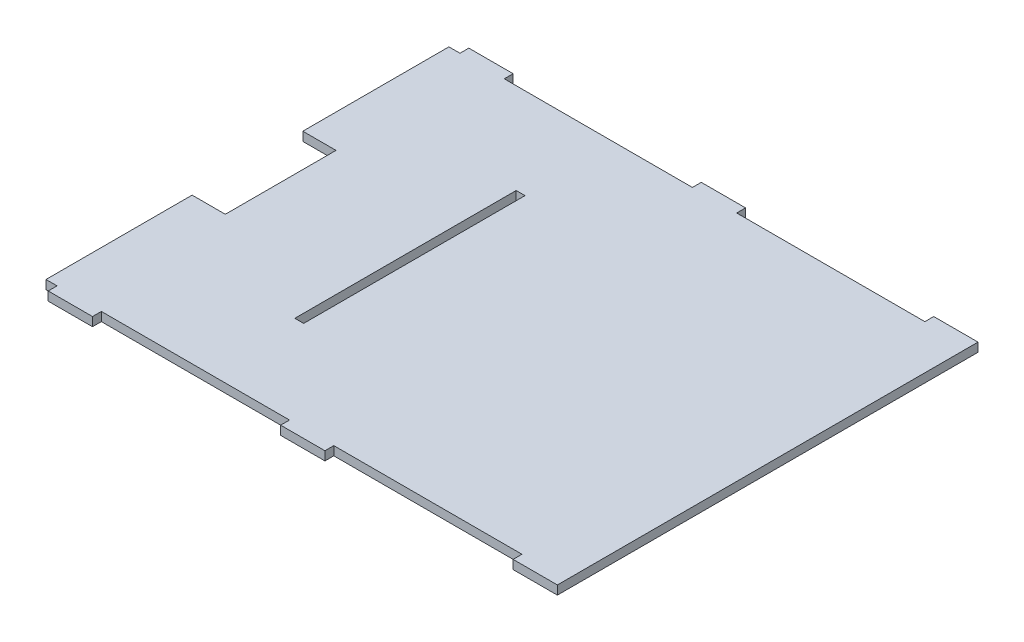
ISO-10303-21;
HEADER;
FILE_DESCRIPTION(('STEP AP214'),'2;1');
FILE_NAME('part.step','',(''),(''),'','','');
FILE_SCHEMA(('AUTOMOTIVE_DESIGN { 1 0 10303 214 1 1 1 1 }'));
ENDSEC;
DATA;
#1=APPLICATION_CONTEXT('core data for automotive mechanical design processes');
#2=APPLICATION_PROTOCOL_DEFINITION('international standard','automotive_design',2000,#1);
#3=PRODUCT_CONTEXT('',#1,'mechanical');
#4=PRODUCT('Part','Part','',(#3));
#5=PRODUCT_RELATED_PRODUCT_CATEGORY('part','',(#4));
#6=PRODUCT_DEFINITION_FORMATION('','',#4);
#7=PRODUCT_DEFINITION_CONTEXT('part definition',#1,'design');
#8=PRODUCT_DEFINITION('design','',#6,#7);
#9=PRODUCT_DEFINITION_SHAPE('','',#8);
#10=(LENGTH_UNIT() NAMED_UNIT(*) SI_UNIT(.MILLI.,.METRE.));
#11=(NAMED_UNIT(*) PLANE_ANGLE_UNIT() SI_UNIT($,.RADIAN.));
#12=(NAMED_UNIT(*) SI_UNIT($,.STERADIAN.) SOLID_ANGLE_UNIT());
#13=UNCERTAINTY_MEASURE_WITH_UNIT(LENGTH_MEASURE(1.E-05),#10,'distance_accuracy_value','');
#14=(GEOMETRIC_REPRESENTATION_CONTEXT(3) GLOBAL_UNCERTAINTY_ASSIGNED_CONTEXT((#13)) GLOBAL_UNIT_ASSIGNED_CONTEXT((#10,
#11,#12)) REPRESENTATION_CONTEXT('',''));
#15=CARTESIAN_POINT('',(0.,0.,0.));
#16=DIRECTION('',(0.,0.,1.));
#17=DIRECTION('',(1.,0.,0.));
#18=AXIS2_PLACEMENT_3D('',#15,#16,#17);
#19=CARTESIAN_POINT('',(-117.5,4.,-90.));
#20=DIRECTION('',(1.,0.,0.));
#21=DIRECTION('',(0.,0.,-1.));
#22=AXIS2_PLACEMENT_3D('',#19,#20,#21);
#23=PLANE('',#22);
#24=DIRECTION('',(0.,0.,1.));
#25=VECTOR('',#24,1.);
#26=CARTESIAN_POINT('',(-117.5,4.,-90.));
#27=LINE('',#26,#25);
#28=CARTESIAN_POINT('',(-117.5,4.,26.));
#29=VERTEX_POINT('',#28);
#30=CARTESIAN_POINT('',(-117.5,4.,92.));
#31=VERTEX_POINT('',#30);
#32=EDGE_CURVE('E485',#29,#31,#27,.T.);
#33=ORIENTED_EDGE('',*,*,#32,.F.);
#34=DIRECTION('',(0.,-1.,0.));
#35=VECTOR('',#34,1.);
#36=CARTESIAN_POINT('',(-117.5,4.,26.));
#37=LINE('',#36,#35);
#38=CARTESIAN_POINT('',(-117.5,0.,26.));
#39=VERTEX_POINT('',#38);
#40=EDGE_CURVE('E367',#29,#39,#37,.T.);
#41=ORIENTED_EDGE('',*,*,#40,.T.);
#42=DIRECTION('',(0.,0.,1.));
#43=VECTOR('',#42,1.);
#44=CARTESIAN_POINT('',(-117.5,0.,-90.));
#45=LINE('',#44,#43);
#46=CARTESIAN_POINT('',(-117.5,0.,92.));
#47=VERTEX_POINT('',#46);
#48=EDGE_CURVE('E576',#39,#47,#45,.T.);
#49=ORIENTED_EDGE('',*,*,#48,.T.);
#50=DIRECTION('',(0.,-1.,0.));
#51=VECTOR('',#50,1.);
#52=CARTESIAN_POINT('',(-117.5,4.,92.));
#53=LINE('',#52,#51);
#54=EDGE_CURVE('E604',#31,#47,#53,.T.);
#55=ORIENTED_EDGE('',*,*,#54,.F.);
#56=EDGE_LOOP('',(#33,#41,#49,#55));
#57=FACE_BOUND('',#56,.T.);
#58=ADVANCED_FACE('F122',(#57),#23,.F.);
#59=CARTESIAN_POINT('',(-92.5,4.,-94.));
#60=DIRECTION('',(1.,0.,0.));
#61=DIRECTION('',(0.,0.,-1.));
#62=AXIS2_PLACEMENT_3D('',#59,#60,#61);
#63=PLANE('',#62);
#64=DIRECTION('',(0.,0.,1.));
#65=VECTOR('',#64,1.);
#66=CARTESIAN_POINT('',(-92.5,0.,-94.));
#67=LINE('',#66,#65);
#68=CARTESIAN_POINT('',(-92.5,0.,-94.));
#69=VERTEX_POINT('',#68);
#70=CARTESIAN_POINT('',(-92.5,0.,-90.));
#71=VERTEX_POINT('',#70);
#72=EDGE_CURVE('E403',#69,#71,#67,.T.);
#73=ORIENTED_EDGE('',*,*,#72,.F.);
#74=DIRECTION('',(0.,-1.,0.));
#75=VECTOR('',#74,1.);
#76=CARTESIAN_POINT('',(-92.5,4.,-94.));
#77=LINE('',#76,#75);
#78=CARTESIAN_POINT('',(-92.5,4.,-94.));
#79=VERTEX_POINT('',#78);
#80=EDGE_CURVE('E592',#79,#69,#77,.T.);
#81=ORIENTED_EDGE('',*,*,#80,.F.);
#82=DIRECTION('',(0.,0.,1.));
#83=VECTOR('',#82,1.);
#84=CARTESIAN_POINT('',(-92.5,4.,-94.));
#85=LINE('',#84,#83);
#86=CARTESIAN_POINT('',(-92.5,4.,-90.));
#87=VERTEX_POINT('',#86);
#88=EDGE_CURVE('E413',#79,#87,#85,.T.);
#89=ORIENTED_EDGE('',*,*,#88,.T.);
#90=DIRECTION('',(0.,-1.,0.));
#91=VECTOR('',#90,1.);
#92=CARTESIAN_POINT('',(-92.5,4.,-90.));
#93=LINE('',#92,#91);
#94=EDGE_CURVE('E500',#87,#71,#93,.T.);
#95=ORIENTED_EDGE('',*,*,#94,.T.);
#96=EDGE_LOOP('',(#73,#81,#89,#95));
#97=FACE_BOUND('',#96,.T.);
#98=ADVANCED_FACE('F124',(#97),#63,.T.);
#99=CARTESIAN_POINT('',(-112.5,4.,-93.9999999999999));
#100=DIRECTION('',(0.,0.,-1.));
#101=DIRECTION('',(-1.,0.,0.));
#102=AXIS2_PLACEMENT_3D('',#99,#100,#101);
#103=PLANE('',#102);
#104=DIRECTION('',(1.,0.,0.));
#105=VECTOR('',#104,1.);
#106=CARTESIAN_POINT('',(-112.5,0.,-93.9999999999999));
#107=LINE('',#106,#105);
#108=CARTESIAN_POINT('',(-112.5,0.,-93.9999999999999));
#109=VERTEX_POINT('',#108);
#110=EDGE_CURVE('E418',#109,#69,#107,.T.);
#111=ORIENTED_EDGE('',*,*,#110,.F.);
#112=DIRECTION('',(0.,-1.,0.));
#113=VECTOR('',#112,1.);
#114=CARTESIAN_POINT('',(-112.5,4.,-93.9999999999999));
#115=LINE('',#114,#113);
#116=CARTESIAN_POINT('',(-112.5,4.,-93.9999999999999));
#117=VERTEX_POINT('',#116);
#118=EDGE_CURVE('E595',#117,#109,#115,.T.);
#119=ORIENTED_EDGE('',*,*,#118,.F.);
#120=DIRECTION('',(1.,0.,0.));
#121=VECTOR('',#120,1.);
#122=CARTESIAN_POINT('',(-112.5,4.,-93.9999999999999));
#123=LINE('',#122,#121);
#124=EDGE_CURVE('E496',#117,#79,#123,.T.);
#125=ORIENTED_EDGE('',*,*,#124,.T.);
#126=ORIENTED_EDGE('',*,*,#80,.T.);
#127=EDGE_LOOP('',(#111,#119,#125,#126));
#128=FACE_BOUND('',#127,.T.);
#129=ADVANCED_FACE('F770',(#128),#103,.T.);
#130=CARTESIAN_POINT('',(-112.5,4.,-90.));
#131=DIRECTION('',(-1.,0.,0.));
#132=DIRECTION('',(0.,0.,1.));
#133=AXIS2_PLACEMENT_3D('',#130,#131,#132);
#134=PLANE('',#133);
#135=DIRECTION('',(0.,0.,-1.));
#136=VECTOR('',#135,1.);
#137=CARTESIAN_POINT('',(-112.5,0.,-90.));
#138=LINE('',#137,#136);
#139=CARTESIAN_POINT('',(-112.5,0.,-90.));
#140=VERTEX_POINT('',#139);
#141=EDGE_CURVE('E585',#140,#109,#138,.T.);
#142=ORIENTED_EDGE('',*,*,#141,.F.);
#143=DIRECTION('',(0.,-1.,0.));
#144=VECTOR('',#143,1.);
#145=CARTESIAN_POINT('',(-112.5,4.,-90.));
#146=LINE('',#145,#144);
#147=CARTESIAN_POINT('',(-112.5,4.,-90.));
#148=VERTEX_POINT('',#147);
#149=EDGE_CURVE('E598',#148,#140,#146,.T.);
#150=ORIENTED_EDGE('',*,*,#149,.F.);
#151=DIRECTION('',(0.,0.,-1.));
#152=VECTOR('',#151,1.);
#153=CARTESIAN_POINT('',(-112.5,4.,-90.));
#154=LINE('',#153,#152);
#155=EDGE_CURVE('E492',#148,#117,#154,.T.);
#156=ORIENTED_EDGE('',*,*,#155,.T.);
#157=ORIENTED_EDGE('',*,*,#118,.T.);
#158=EDGE_LOOP('',(#142,#150,#156,#157));
#159=FACE_BOUND('',#158,.T.);
#160=ADVANCED_FACE('F779',(#159),#134,.T.);
#161=CARTESIAN_POINT('',(-117.5,4.,-90.));
#162=DIRECTION('',(0.,0.,-1.));
#163=DIRECTION('',(-1.,0.,0.));
#164=AXIS2_PLACEMENT_3D('',#161,#162,#163);
#165=PLANE('',#164);
#166=DIRECTION('',(1.,0.,0.));
#167=VECTOR('',#166,1.);
#168=CARTESIAN_POINT('',(-117.5,0.,-90.));
#169=LINE('',#168,#167);
#170=CARTESIAN_POINT('',(-117.5,0.,-90.));
#171=VERTEX_POINT('',#170);
#172=EDGE_CURVE('E581',#171,#140,#169,.T.);
#173=ORIENTED_EDGE('',*,*,#172,.F.);
#174=DIRECTION('',(0.,-1.,0.));
#175=VECTOR('',#174,1.);
#176=CARTESIAN_POINT('',(-117.5,4.,-90.));
#177=LINE('',#176,#175);
#178=CARTESIAN_POINT('',(-117.5,4.,-90.));
#179=VERTEX_POINT('',#178);
#180=EDGE_CURVE('E601',#179,#171,#177,.T.);
#181=ORIENTED_EDGE('',*,*,#180,.F.);
#182=DIRECTION('',(1.,0.,0.));
#183=VECTOR('',#182,1.);
#184=CARTESIAN_POINT('',(-117.5,4.,-90.));
#185=LINE('',#184,#183);
#186=EDGE_CURVE('E488',#179,#148,#185,.T.);
#187=ORIENTED_EDGE('',*,*,#186,.T.);
#188=ORIENTED_EDGE('',*,*,#149,.T.);
#189=EDGE_LOOP('',(#173,#181,#187,#188));
#190=FACE_BOUND('',#189,.T.);
#191=ADVANCED_FACE('F775',(#190),#165,.T.);
#192=CARTESIAN_POINT('',(-117.5,0.,-24.));
#193=VERTEX_POINT('',#192);
#194=EDGE_CURVE('E577',#171,#193,#45,.T.);
#195=ORIENTED_EDGE('',*,*,#194,.T.);
#196=DIRECTION('',(0.,1.,0.));
#197=VECTOR('',#196,1.);
#198=CARTESIAN_POINT('',(-117.5,4.,-24.));
#199=LINE('',#198,#197);
#200=CARTESIAN_POINT('',(-117.5,4.,-24.));
#201=VERTEX_POINT('',#200);
#202=EDGE_CURVE('E138',#193,#201,#199,.T.);
#203=ORIENTED_EDGE('',*,*,#202,.T.);
#204=EDGE_CURVE('E357',#179,#201,#27,.T.);
#205=ORIENTED_EDGE('',*,*,#204,.F.);
#206=ORIENTED_EDGE('',*,*,#180,.T.);
#207=EDGE_LOOP('',(#195,#203,#205,#206));
#208=FACE_BOUND('',#207,.T.);
#209=ADVANCED_FACE('F778',(#208),#23,.F.);
#210=CARTESIAN_POINT('',(-117.5,4.,92.));
#211=DIRECTION('',(0.,0.,-1.));
#212=DIRECTION('',(-1.,0.,0.));
#213=AXIS2_PLACEMENT_3D('',#210,#211,#212);
#214=PLANE('',#213);
#215=DIRECTION('',(1.,0.,0.));
#216=VECTOR('',#215,1.);
#217=CARTESIAN_POINT('',(-117.5,0.,92.));
#218=LINE('',#217,#216);
#219=CARTESIAN_POINT('',(-112.5,0.,92.));
#220=VERTEX_POINT('',#219);
#221=EDGE_CURVE('E573',#47,#220,#218,.T.);
#222=ORIENTED_EDGE('',*,*,#221,.T.);
#223=DIRECTION('',(0.,-1.,0.));
#224=VECTOR('',#223,1.);
#225=CARTESIAN_POINT('',(-112.5,4.,92.));
#226=LINE('',#225,#224);
#227=CARTESIAN_POINT('',(-112.5,4.,92.));
#228=VERTEX_POINT('',#227);
#229=EDGE_CURVE('E608',#228,#220,#226,.T.);
#230=ORIENTED_EDGE('',*,*,#229,.F.);
#231=DIRECTION('',(1.,0.,0.));
#232=VECTOR('',#231,1.);
#233=CARTESIAN_POINT('',(-117.5,4.,92.));
#234=LINE('',#233,#232);
#235=EDGE_CURVE('E482',#31,#228,#234,.T.);
#236=ORIENTED_EDGE('',*,*,#235,.F.);
#237=ORIENTED_EDGE('',*,*,#54,.T.);
#238=EDGE_LOOP('',(#222,#230,#236,#237));
#239=FACE_BOUND('',#238,.T.);
#240=ADVANCED_FACE('F684',(#239),#214,.F.);
#241=CARTESIAN_POINT('',(-112.5,4.,92.));
#242=DIRECTION('',(1.,0.,0.));
#243=DIRECTION('',(0.,0.,-1.));
#244=AXIS2_PLACEMENT_3D('',#241,#242,#243);
#245=PLANE('',#244);
#246=DIRECTION('',(0.,0.,1.));
#247=VECTOR('',#246,1.);
#248=CARTESIAN_POINT('',(-112.5,0.,92.));
#249=LINE('',#248,#247);
#250=CARTESIAN_POINT('',(-112.5,0.,96.));
#251=VERTEX_POINT('',#250);
#252=EDGE_CURVE('E569',#220,#251,#249,.T.);
#253=ORIENTED_EDGE('',*,*,#252,.T.);
#254=DIRECTION('',(0.,-1.,0.));
#255=VECTOR('',#254,1.);
#256=CARTESIAN_POINT('',(-112.5,4.,96.));
#257=LINE('',#256,#255);
#258=CARTESIAN_POINT('',(-112.5,4.,96.));
#259=VERTEX_POINT('',#258);
#260=EDGE_CURVE('E612',#259,#251,#257,.T.);
#261=ORIENTED_EDGE('',*,*,#260,.F.);
#262=DIRECTION('',(0.,0.,1.));
#263=VECTOR('',#262,1.);
#264=CARTESIAN_POINT('',(-112.5,4.,92.));
#265=LINE('',#264,#263);
#266=EDGE_CURVE('E479',#228,#259,#265,.T.);
#267=ORIENTED_EDGE('',*,*,#266,.F.);
#268=ORIENTED_EDGE('',*,*,#229,.T.);
#269=EDGE_LOOP('',(#253,#261,#267,#268));
#270=FACE_BOUND('',#269,.T.);
#271=ADVANCED_FACE('F691',(#270),#245,.F.);
#272=CARTESIAN_POINT('',(-92.5,4.,96.));
#273=DIRECTION('',(0.,0.,1.));
#274=DIRECTION('',(1.,0.,0.));
#275=AXIS2_PLACEMENT_3D('',#272,#273,#274);
#276=PLANE('',#275);
#277=DIRECTION('',(-1.,0.,0.));
#278=VECTOR('',#277,1.);
#279=CARTESIAN_POINT('',(-92.5,0.,96.));
#280=LINE('',#279,#278);
#281=CARTESIAN_POINT('',(-92.5,0.,96.));
#282=VERTEX_POINT('',#281);
#283=EDGE_CURVE('E565',#282,#251,#280,.T.);
#284=ORIENTED_EDGE('',*,*,#283,.F.);
#285=DIRECTION('',(0.,-1.,0.));
#286=VECTOR('',#285,1.);
#287=CARTESIAN_POINT('',(-92.5,4.,96.));
#288=LINE('',#287,#286);
#289=CARTESIAN_POINT('',(-92.5,4.,96.));
#290=VERTEX_POINT('',#289);
#291=EDGE_CURVE('E615',#290,#282,#288,.T.);
#292=ORIENTED_EDGE('',*,*,#291,.F.);
#293=DIRECTION('',(-1.,0.,0.));
#294=VECTOR('',#293,1.);
#295=CARTESIAN_POINT('',(-92.5,4.,96.));
#296=LINE('',#295,#294);
#297=EDGE_CURVE('E475',#290,#259,#296,.T.);
#298=ORIENTED_EDGE('',*,*,#297,.T.);
#299=ORIENTED_EDGE('',*,*,#260,.T.);
#300=EDGE_LOOP('',(#284,#292,#298,#299));
#301=FACE_BOUND('',#300,.T.);
#302=ADVANCED_FACE('F697',(#301),#276,.T.);
#303=CARTESIAN_POINT('',(-92.5,4.,96.));
#304=DIRECTION('',(-1.,0.,0.));
#305=DIRECTION('',(0.,0.,1.));
#306=AXIS2_PLACEMENT_3D('',#303,#304,#305);
#307=PLANE('',#306);
#308=DIRECTION('',(0.,0.,-1.));
#309=VECTOR('',#308,1.);
#310=CARTESIAN_POINT('',(-92.5,0.,96.));
#311=LINE('',#310,#309);
#312=CARTESIAN_POINT('',(-92.5,0.,92.));
#313=VERTEX_POINT('',#312);
#314=EDGE_CURVE('E562',#282,#313,#311,.T.);
#315=ORIENTED_EDGE('',*,*,#314,.T.);
#316=DIRECTION('',(0.,-1.,0.));
#317=VECTOR('',#316,1.);
#318=CARTESIAN_POINT('',(-92.5,4.,92.));
#319=LINE('',#318,#317);
#320=CARTESIAN_POINT('',(-92.5,4.,92.));
#321=VERTEX_POINT('',#320);
#322=EDGE_CURVE('E618',#321,#313,#319,.T.);
#323=ORIENTED_EDGE('',*,*,#322,.F.);
#324=DIRECTION('',(0.,0.,-1.));
#325=VECTOR('',#324,1.);
#326=CARTESIAN_POINT('',(-92.5,4.,96.));
#327=LINE('',#326,#325);
#328=EDGE_CURVE('E472',#290,#321,#327,.T.);
#329=ORIENTED_EDGE('',*,*,#328,.F.);
#330=ORIENTED_EDGE('',*,*,#291,.T.);
#331=EDGE_LOOP('',(#315,#323,#329,#330));
#332=FACE_BOUND('',#331,.T.);
#333=ADVANCED_FACE('F699',(#332),#307,.F.);
#334=CARTESIAN_POINT('',(-92.5,4.,92.));
#335=DIRECTION('',(0.,0.,-1.));
#336=DIRECTION('',(-1.,0.,0.));
#337=AXIS2_PLACEMENT_3D('',#334,#335,#336);
#338=PLANE('',#337);
#339=DIRECTION('',(1.,0.,0.));
#340=VECTOR('',#339,1.);
#341=CARTESIAN_POINT('',(-92.5,0.,92.));
#342=LINE('',#341,#340);
#343=CARTESIAN_POINT('',(-7.50000000000002,0.,92.));
#344=VERTEX_POINT('',#343);
#345=EDGE_CURVE('E559',#313,#344,#342,.T.);
#346=ORIENTED_EDGE('',*,*,#345,.T.);
#347=DIRECTION('',(0.,-1.,0.));
#348=VECTOR('',#347,1.);
#349=CARTESIAN_POINT('',(-7.50000000000002,4.,92.));
#350=LINE('',#349,#348);
#351=CARTESIAN_POINT('',(-7.50000000000002,4.,92.));
#352=VERTEX_POINT('',#351);
#353=EDGE_CURVE('E622',#352,#344,#350,.T.);
#354=ORIENTED_EDGE('',*,*,#353,.F.);
#355=DIRECTION('',(1.,0.,0.));
#356=VECTOR('',#355,1.);
#357=CARTESIAN_POINT('',(-92.5,4.,92.));
#358=LINE('',#357,#356);
#359=EDGE_CURVE('E469',#321,#352,#358,.T.);
#360=ORIENTED_EDGE('',*,*,#359,.F.);
#361=ORIENTED_EDGE('',*,*,#322,.T.);
#362=EDGE_LOOP('',(#346,#354,#360,#361));
#363=FACE_BOUND('',#362,.T.);
#364=ADVANCED_FACE('F704',(#363),#338,.F.);
#365=CARTESIAN_POINT('',(-7.50000000000002,4.,92.));
#366=DIRECTION('',(1.,0.,0.));
#367=DIRECTION('',(0.,0.,-1.));
#368=AXIS2_PLACEMENT_3D('',#365,#366,#367);
#369=PLANE('',#368);
#370=DIRECTION('',(0.,0.,1.));
#371=VECTOR('',#370,1.);
#372=CARTESIAN_POINT('',(-7.50000000000002,0.,92.));
#373=LINE('',#372,#371);
#374=CARTESIAN_POINT('',(-7.50000000000004,0.,96.));
#375=VERTEX_POINT('',#374);
#376=EDGE_CURVE('E555',#344,#375,#373,.T.);
#377=ORIENTED_EDGE('',*,*,#376,.T.);
#378=DIRECTION('',(0.,-1.,0.));
#379=VECTOR('',#378,1.);
#380=CARTESIAN_POINT('',(-7.50000000000004,4.,96.));
#381=LINE('',#380,#379);
#382=CARTESIAN_POINT('',(-7.50000000000004,4.,96.));
#383=VERTEX_POINT('',#382);
#384=EDGE_CURVE('E626',#383,#375,#381,.T.);
#385=ORIENTED_EDGE('',*,*,#384,.F.);
#386=DIRECTION('',(0.,0.,1.));
#387=VECTOR('',#386,1.);
#388=CARTESIAN_POINT('',(-7.50000000000002,4.,92.));
#389=LINE('',#388,#387);
#390=EDGE_CURVE('E466',#352,#383,#389,.T.);
#391=ORIENTED_EDGE('',*,*,#390,.F.);
#392=ORIENTED_EDGE('',*,*,#353,.T.);
#393=EDGE_LOOP('',(#377,#385,#391,#392));
#394=FACE_BOUND('',#393,.T.);
#395=ADVANCED_FACE('F709',(#394),#369,.F.);
#396=CARTESIAN_POINT('',(12.5,4.,96.));
#397=DIRECTION('',(0.,0.,1.));
#398=DIRECTION('',(1.,0.,0.));
#399=AXIS2_PLACEMENT_3D('',#396,#397,#398);
#400=PLANE('',#399);
#401=DIRECTION('',(-1.,0.,0.));
#402=VECTOR('',#401,1.);
#403=CARTESIAN_POINT('',(12.5,0.,96.));
#404=LINE('',#403,#402);
#405=CARTESIAN_POINT('',(12.5,0.,96.));
#406=VERTEX_POINT('',#405);
#407=EDGE_CURVE('E551',#406,#375,#404,.T.);
#408=ORIENTED_EDGE('',*,*,#407,.F.);
#409=DIRECTION('',(0.,-1.,0.));
#410=VECTOR('',#409,1.);
#411=CARTESIAN_POINT('',(12.5,4.,96.));
#412=LINE('',#411,#410);
#413=CARTESIAN_POINT('',(12.5,4.,96.));
#414=VERTEX_POINT('',#413);
#415=EDGE_CURVE('E629',#414,#406,#412,.T.);
#416=ORIENTED_EDGE('',*,*,#415,.F.);
#417=DIRECTION('',(-1.,0.,0.));
#418=VECTOR('',#417,1.);
#419=CARTESIAN_POINT('',(12.5,4.,96.));
#420=LINE('',#419,#418);
#421=EDGE_CURVE('E462',#414,#383,#420,.T.);
#422=ORIENTED_EDGE('',*,*,#421,.T.);
#423=ORIENTED_EDGE('',*,*,#384,.T.);
#424=EDGE_LOOP('',(#408,#416,#422,#423));
#425=FACE_BOUND('',#424,.T.);
#426=ADVANCED_FACE('F713',(#425),#400,.T.);
#427=CARTESIAN_POINT('',(12.5,4.,96.));
#428=DIRECTION('',(-1.,0.,0.));
#429=DIRECTION('',(0.,0.,1.));
#430=AXIS2_PLACEMENT_3D('',#427,#428,#429);
#431=PLANE('',#430);
#432=DIRECTION('',(0.,0.,-1.));
#433=VECTOR('',#432,1.);
#434=CARTESIAN_POINT('',(12.5,0.,96.));
#435=LINE('',#434,#433);
#436=CARTESIAN_POINT('',(12.5,0.,92.));
#437=VERTEX_POINT('',#436);
#438=EDGE_CURVE('E548',#406,#437,#435,.T.);
#439=ORIENTED_EDGE('',*,*,#438,.T.);
#440=DIRECTION('',(0.,-1.,0.));
#441=VECTOR('',#440,1.);
#442=CARTESIAN_POINT('',(12.5,4.,92.));
#443=LINE('',#442,#441);
#444=CARTESIAN_POINT('',(12.5,4.,92.));
#445=VERTEX_POINT('',#444);
#446=EDGE_CURVE('E632',#445,#437,#443,.T.);
#447=ORIENTED_EDGE('',*,*,#446,.F.);
#448=DIRECTION('',(0.,0.,-1.));
#449=VECTOR('',#448,1.);
#450=CARTESIAN_POINT('',(12.5,4.,96.));
#451=LINE('',#450,#449);
#452=EDGE_CURVE('E459',#414,#445,#451,.T.);
#453=ORIENTED_EDGE('',*,*,#452,.F.);
#454=ORIENTED_EDGE('',*,*,#415,.T.);
#455=EDGE_LOOP('',(#439,#447,#453,#454));
#456=FACE_BOUND('',#455,.T.);
#457=ADVANCED_FACE('F718',(#456),#431,.F.);
#458=CARTESIAN_POINT('',(12.5,4.,92.));
#459=DIRECTION('',(0.,0.,-1.));
#460=DIRECTION('',(-1.,0.,0.));
#461=AXIS2_PLACEMENT_3D('',#458,#459,#460);
#462=PLANE('',#461);
#463=DIRECTION('',(1.,0.,0.));
#464=VECTOR('',#463,1.);
#465=CARTESIAN_POINT('',(12.5,0.,92.));
#466=LINE('',#465,#464);
#467=CARTESIAN_POINT('',(97.4999999999998,0.,92.));
#468=VERTEX_POINT('',#467);
#469=EDGE_CURVE('E544',#437,#468,#466,.T.);
#470=ORIENTED_EDGE('',*,*,#469,.T.);
#471=DIRECTION('',(0.,-1.,0.));
#472=VECTOR('',#471,1.);
#473=CARTESIAN_POINT('',(97.4999999999998,4.,92.));
#474=LINE('',#473,#472);
#475=CARTESIAN_POINT('',(97.4999999999998,4.,92.));
#476=VERTEX_POINT('',#475);
#477=EDGE_CURVE('E636',#476,#468,#474,.T.);
#478=ORIENTED_EDGE('',*,*,#477,.F.);
#479=DIRECTION('',(1.,0.,0.));
#480=VECTOR('',#479,1.);
#481=CARTESIAN_POINT('',(12.5,4.,92.));
#482=LINE('',#481,#480);
#483=EDGE_CURVE('E456',#445,#476,#482,.T.);
#484=ORIENTED_EDGE('',*,*,#483,.F.);
#485=ORIENTED_EDGE('',*,*,#446,.T.);
#486=EDGE_LOOP('',(#470,#478,#484,#485));
#487=FACE_BOUND('',#486,.T.);
#488=ADVANCED_FACE('F723',(#487),#462,.F.);
#489=CARTESIAN_POINT('',(97.4999999999998,4.,96.));
#490=DIRECTION('',(-1.,0.,0.));
#491=DIRECTION('',(0.,0.,1.));
#492=AXIS2_PLACEMENT_3D('',#489,#490,#491);
#493=PLANE('',#492);
#494=DIRECTION('',(0.,0.,-1.));
#495=VECTOR('',#494,1.);
#496=CARTESIAN_POINT('',(97.4999999999998,0.,96.));
#497=LINE('',#496,#495);
#498=CARTESIAN_POINT('',(97.4999999999998,0.,96.));
#499=VERTEX_POINT('',#498);
#500=EDGE_CURVE('E540',#499,#468,#497,.T.);
#501=ORIENTED_EDGE('',*,*,#500,.F.);
#502=DIRECTION('',(0.,-1.,0.));
#503=VECTOR('',#502,1.);
#504=CARTESIAN_POINT('',(97.4999999999998,4.,96.));
#505=LINE('',#504,#503);
#506=CARTESIAN_POINT('',(97.4999999999998,4.,96.));
#507=VERTEX_POINT('',#506);
#508=EDGE_CURVE('E639',#507,#499,#505,.T.);
#509=ORIENTED_EDGE('',*,*,#508,.F.);
#510=DIRECTION('',(0.,0.,-1.));
#511=VECTOR('',#510,1.);
#512=CARTESIAN_POINT('',(97.4999999999998,4.,96.));
#513=LINE('',#512,#511);
#514=EDGE_CURVE('E452',#507,#476,#513,.T.);
#515=ORIENTED_EDGE('',*,*,#514,.T.);
#516=ORIENTED_EDGE('',*,*,#477,.T.);
#517=EDGE_LOOP('',(#501,#509,#515,#516));
#518=FACE_BOUND('',#517,.T.);
#519=ADVANCED_FACE('F727',(#518),#493,.T.);
#520=CARTESIAN_POINT('',(97.4999999999998,4.,96.));
#521=DIRECTION('',(0.,0.,-1.));
#522=DIRECTION('',(-1.,0.,0.));
#523=AXIS2_PLACEMENT_3D('',#520,#521,#522);
#524=PLANE('',#523);
#525=DIRECTION('',(1.,0.,0.));
#526=VECTOR('',#525,1.);
#527=CARTESIAN_POINT('',(97.4999999999998,0.,96.));
#528=LINE('',#527,#526);
#529=CARTESIAN_POINT('',(117.5,0.,96.));
#530=VERTEX_POINT('',#529);
#531=EDGE_CURVE('E536',#499,#530,#528,.T.);
#532=ORIENTED_EDGE('',*,*,#531,.T.);
#533=DIRECTION('',(0.,-1.,0.));
#534=VECTOR('',#533,1.);
#535=CARTESIAN_POINT('',(117.5,4.,96.));
#536=LINE('',#535,#534);
#537=CARTESIAN_POINT('',(117.5,4.,96.));
#538=VERTEX_POINT('',#537);
#539=EDGE_CURVE('E642',#538,#530,#536,.T.);
#540=ORIENTED_EDGE('',*,*,#539,.F.);
#541=DIRECTION('',(1.,0.,0.));
#542=VECTOR('',#541,1.);
#543=CARTESIAN_POINT('',(97.4999999999998,4.,96.));
#544=LINE('',#543,#542);
#545=EDGE_CURVE('E449',#507,#538,#544,.T.);
#546=ORIENTED_EDGE('',*,*,#545,.F.);
#547=ORIENTED_EDGE('',*,*,#508,.T.);
#548=EDGE_LOOP('',(#532,#540,#546,#547));
#549=FACE_BOUND('',#548,.T.);
#550=ADVANCED_FACE('F732',(#549),#524,.F.);
#551=CARTESIAN_POINT('',(117.5,4.,-94.));
#552=DIRECTION('',(1.,0.,0.));
#553=DIRECTION('',(0.,0.,-1.));
#554=AXIS2_PLACEMENT_3D('',#551,#552,#553);
#555=PLANE('',#554);
#556=DIRECTION('',(0.,0.,1.));
#557=VECTOR('',#556,1.);
#558=CARTESIAN_POINT('',(117.5,0.,-94.));
#559=LINE('',#558,#557);
#560=CARTESIAN_POINT('',(117.5,0.,-94.));
#561=VERTEX_POINT('',#560);
#562=EDGE_CURVE('E532',#561,#530,#559,.T.);
#563=ORIENTED_EDGE('',*,*,#562,.F.);
#564=DIRECTION('',(0.,-1.,0.));
#565=VECTOR('',#564,1.);
#566=CARTESIAN_POINT('',(117.5,4.,-94.));
#567=LINE('',#566,#565);
#568=CARTESIAN_POINT('',(117.5,4.,-94.));
#569=VERTEX_POINT('',#568);
#570=EDGE_CURVE('E645',#569,#561,#567,.T.);
#571=ORIENTED_EDGE('',*,*,#570,.F.);
#572=DIRECTION('',(0.,0.,1.));
#573=VECTOR('',#572,1.);
#574=CARTESIAN_POINT('',(117.5,4.,-94.));
#575=LINE('',#574,#573);
#576=EDGE_CURVE('E445',#569,#538,#575,.T.);
#577=ORIENTED_EDGE('',*,*,#576,.T.);
#578=ORIENTED_EDGE('',*,*,#539,.T.);
#579=EDGE_LOOP('',(#563,#571,#577,#578));
#580=FACE_BOUND('',#579,.T.);
#581=ADVANCED_FACE('F823',(#580),#555,.T.);
#582=CARTESIAN_POINT('',(97.4999999999997,4.,-93.9999999999999));
#583=DIRECTION('',(0.,0.,-1.));
#584=DIRECTION('',(-1.,0.,0.));
#585=AXIS2_PLACEMENT_3D('',#582,#583,#584);
#586=PLANE('',#585);
#587=DIRECTION('',(1.,0.,0.));
#588=VECTOR('',#587,1.);
#589=CARTESIAN_POINT('',(97.4999999999997,0.,-93.9999999999999));
#590=LINE('',#589,#588);
#591=CARTESIAN_POINT('',(97.4999999999997,0.,-93.9999999999999));
#592=VERTEX_POINT('',#591);
#593=EDGE_CURVE('E528',#592,#561,#590,.T.);
#594=ORIENTED_EDGE('',*,*,#593,.F.);
#595=DIRECTION('',(0.,-1.,0.));
#596=VECTOR('',#595,1.);
#597=CARTESIAN_POINT('',(97.4999999999997,4.,-93.9999999999999));
#598=LINE('',#597,#596);
#599=CARTESIAN_POINT('',(97.4999999999997,4.,-93.9999999999999));
#600=VERTEX_POINT('',#599);
#601=EDGE_CURVE('E648',#600,#592,#598,.T.);
#602=ORIENTED_EDGE('',*,*,#601,.F.);
#603=DIRECTION('',(1.,0.,0.));
#604=VECTOR('',#603,1.);
#605=CARTESIAN_POINT('',(97.4999999999997,4.,-93.9999999999999));
#606=LINE('',#605,#604);
#607=EDGE_CURVE('E441',#600,#569,#606,.T.);
#608=ORIENTED_EDGE('',*,*,#607,.T.);
#609=ORIENTED_EDGE('',*,*,#570,.T.);
#610=EDGE_LOOP('',(#594,#602,#608,#609));
#611=FACE_BOUND('',#610,.T.);
#612=ADVANCED_FACE('F738',(#611),#586,.T.);
#613=CARTESIAN_POINT('',(97.4999999999997,4.,-93.9999999999999));
#614=DIRECTION('',(1.,0.,0.));
#615=DIRECTION('',(0.,0.,-1.));
#616=AXIS2_PLACEMENT_3D('',#613,#614,#615);
#617=PLANE('',#616);
#618=DIRECTION('',(0.,0.,1.));
#619=VECTOR('',#618,1.);
#620=CARTESIAN_POINT('',(97.4999999999997,0.,-93.9999999999999));
#621=LINE('',#620,#619);
#622=CARTESIAN_POINT('',(97.4999999999998,0.,-90.));
#623=VERTEX_POINT('',#622);
#624=EDGE_CURVE('E524',#592,#623,#621,.T.);
#625=ORIENTED_EDGE('',*,*,#624,.T.);
#626=DIRECTION('',(0.,-1.,0.));
#627=VECTOR('',#626,1.);
#628=CARTESIAN_POINT('',(97.4999999999998,4.,-90.));
#629=LINE('',#628,#627);
#630=CARTESIAN_POINT('',(97.4999999999998,4.,-90.));
#631=VERTEX_POINT('',#630);
#632=EDGE_CURVE('E651',#631,#623,#629,.T.);
#633=ORIENTED_EDGE('',*,*,#632,.F.);
#634=DIRECTION('',(0.,0.,1.));
#635=VECTOR('',#634,1.);
#636=CARTESIAN_POINT('',(97.4999999999997,4.,-93.9999999999999));
#637=LINE('',#636,#635);
#638=EDGE_CURVE('E438',#600,#631,#637,.T.);
#639=ORIENTED_EDGE('',*,*,#638,.F.);
#640=ORIENTED_EDGE('',*,*,#601,.T.);
#641=EDGE_LOOP('',(#625,#633,#639,#640));
#642=FACE_BOUND('',#641,.T.);
#643=ADVANCED_FACE('F744',(#642),#617,.F.);
#644=CARTESIAN_POINT('',(12.5,4.,-90.));
#645=DIRECTION('',(0.,0.,-1.));
#646=DIRECTION('',(-1.,0.,0.));
#647=AXIS2_PLACEMENT_3D('',#644,#645,#646);
#648=PLANE('',#647);
#649=DIRECTION('',(1.,0.,0.));
#650=VECTOR('',#649,1.);
#651=CARTESIAN_POINT('',(12.5,0.,-90.));
#652=LINE('',#651,#650);
#653=CARTESIAN_POINT('',(12.5,0.,-90.));
#654=VERTEX_POINT('',#653);
#655=EDGE_CURVE('E520',#654,#623,#652,.T.);
#656=ORIENTED_EDGE('',*,*,#655,.F.);
#657=DIRECTION('',(0.,-1.,0.));
#658=VECTOR('',#657,1.);
#659=CARTESIAN_POINT('',(12.5,4.,-90.));
#660=LINE('',#659,#658);
#661=CARTESIAN_POINT('',(12.5,4.,-90.));
#662=VERTEX_POINT('',#661);
#663=EDGE_CURVE('E654',#662,#654,#660,.T.);
#664=ORIENTED_EDGE('',*,*,#663,.F.);
#665=DIRECTION('',(1.,0.,0.));
#666=VECTOR('',#665,1.);
#667=CARTESIAN_POINT('',(12.5,4.,-90.));
#668=LINE('',#667,#666);
#669=EDGE_CURVE('E434',#662,#631,#668,.T.);
#670=ORIENTED_EDGE('',*,*,#669,.T.);
#671=ORIENTED_EDGE('',*,*,#632,.T.);
#672=EDGE_LOOP('',(#656,#664,#670,#671));
#673=FACE_BOUND('',#672,.T.);
#674=ADVANCED_FACE('F830',(#673),#648,.T.);
#675=CARTESIAN_POINT('',(12.4999999999999,4.,-94.));
#676=DIRECTION('',(1.,0.,0.));
#677=DIRECTION('',(0.,0.,-1.));
#678=AXIS2_PLACEMENT_3D('',#675,#676,#677);
#679=PLANE('',#678);
#680=DIRECTION('',(0.,0.,1.));
#681=VECTOR('',#680,1.);
#682=CARTESIAN_POINT('',(12.4999999999999,0.,-94.));
#683=LINE('',#682,#681);
#684=CARTESIAN_POINT('',(12.4999999999999,0.,-94.));
#685=VERTEX_POINT('',#684);
#686=EDGE_CURVE('E516',#685,#654,#683,.T.);
#687=ORIENTED_EDGE('',*,*,#686,.F.);
#688=DIRECTION('',(0.,-1.,0.));
#689=VECTOR('',#688,1.);
#690=CARTESIAN_POINT('',(12.4999999999999,4.,-94.));
#691=LINE('',#690,#689);
#692=CARTESIAN_POINT('',(12.4999999999999,4.,-94.));
#693=VERTEX_POINT('',#692);
#694=EDGE_CURVE('E657',#693,#685,#691,.T.);
#695=ORIENTED_EDGE('',*,*,#694,.F.);
#696=DIRECTION('',(0.,0.,1.));
#697=VECTOR('',#696,1.);
#698=CARTESIAN_POINT('',(12.4999999999999,4.,-94.));
#699=LINE('',#698,#697);
#700=EDGE_CURVE('E430',#693,#662,#699,.T.);
#701=ORIENTED_EDGE('',*,*,#700,.T.);
#702=ORIENTED_EDGE('',*,*,#663,.T.);
#703=EDGE_LOOP('',(#687,#695,#701,#702));
#704=FACE_BOUND('',#703,.T.);
#705=ADVANCED_FACE('F751',(#704),#679,.T.);
#706=CARTESIAN_POINT('',(-7.50000000000008,4.,-94.));
#707=DIRECTION('',(0.,0.,-1.));
#708=DIRECTION('',(-1.,0.,0.));
#709=AXIS2_PLACEMENT_3D('',#706,#707,#708);
#710=PLANE('',#709);
#711=DIRECTION('',(1.,0.,0.));
#712=VECTOR('',#711,1.);
#713=CARTESIAN_POINT('',(-7.50000000000008,0.,-94.));
#714=LINE('',#713,#712);
#715=CARTESIAN_POINT('',(-7.50000000000008,0.,-94.));
#716=VERTEX_POINT('',#715);
#717=EDGE_CURVE('E512',#716,#685,#714,.T.);
#718=ORIENTED_EDGE('',*,*,#717,.F.);
#719=DIRECTION('',(0.,-1.,0.));
#720=VECTOR('',#719,1.);
#721=CARTESIAN_POINT('',(-7.50000000000008,4.,-94.));
#722=LINE('',#721,#720);
#723=CARTESIAN_POINT('',(-7.50000000000008,4.,-94.));
#724=VERTEX_POINT('',#723);
#725=EDGE_CURVE('E660',#724,#716,#722,.T.);
#726=ORIENTED_EDGE('',*,*,#725,.F.);
#727=DIRECTION('',(1.,0.,0.));
#728=VECTOR('',#727,1.);
#729=CARTESIAN_POINT('',(-7.50000000000008,4.,-94.));
#730=LINE('',#729,#728);
#731=EDGE_CURVE('E426',#724,#693,#730,.T.);
#732=ORIENTED_EDGE('',*,*,#731,.T.);
#733=ORIENTED_EDGE('',*,*,#694,.T.);
#734=EDGE_LOOP('',(#718,#726,#732,#733));
#735=FACE_BOUND('',#734,.T.);
#736=ADVANCED_FACE('F755',(#735),#710,.T.);
#737=CARTESIAN_POINT('',(-7.50000000000002,4.,-90.));
#738=DIRECTION('',(-1.,0.,0.));
#739=DIRECTION('',(0.,0.,1.));
#740=AXIS2_PLACEMENT_3D('',#737,#738,#739);
#741=PLANE('',#740);
#742=DIRECTION('',(0.,0.,-1.));
#743=VECTOR('',#742,1.);
#744=CARTESIAN_POINT('',(-7.50000000000002,0.,-90.));
#745=LINE('',#744,#743);
#746=CARTESIAN_POINT('',(-7.50000000000002,0.,-90.));
#747=VERTEX_POINT('',#746);
#748=EDGE_CURVE('E508',#747,#716,#745,.T.);
#749=ORIENTED_EDGE('',*,*,#748,.F.);
#750=DIRECTION('',(0.,-1.,0.));
#751=VECTOR('',#750,1.);
#752=CARTESIAN_POINT('',(-7.50000000000002,4.,-90.));
#753=LINE('',#752,#751);
#754=CARTESIAN_POINT('',(-7.50000000000002,4.,-90.));
#755=VERTEX_POINT('',#754);
#756=EDGE_CURVE('E663',#755,#747,#753,.T.);
#757=ORIENTED_EDGE('',*,*,#756,.F.);
#758=DIRECTION('',(0.,0.,-1.));
#759=VECTOR('',#758,1.);
#760=CARTESIAN_POINT('',(-7.50000000000002,4.,-90.));
#761=LINE('',#760,#759);
#762=EDGE_CURVE('E422',#755,#724,#761,.T.);
#763=ORIENTED_EDGE('',*,*,#762,.T.);
#764=ORIENTED_EDGE('',*,*,#725,.T.);
#765=EDGE_LOOP('',(#749,#757,#763,#764));
#766=FACE_BOUND('',#765,.T.);
#767=ADVANCED_FACE('F760',(#766),#741,.T.);
#768=CARTESIAN_POINT('',(-92.5,4.,-90.));
#769=DIRECTION('',(0.,0.,-1.));
#770=DIRECTION('',(-1.,0.,0.));
#771=AXIS2_PLACEMENT_3D('',#768,#769,#770);
#772=PLANE('',#771);
#773=DIRECTION('',(1.,0.,0.));
#774=VECTOR('',#773,1.);
#775=CARTESIAN_POINT('',(-92.5,0.,-90.));
#776=LINE('',#775,#774);
#777=EDGE_CURVE('E504',#71,#747,#776,.T.);
#778=ORIENTED_EDGE('',*,*,#777,.F.);
#779=ORIENTED_EDGE('',*,*,#94,.F.);
#780=DIRECTION('',(1.,0.,0.));
#781=VECTOR('',#780,1.);
#782=CARTESIAN_POINT('',(-92.5,4.,-90.));
#783=LINE('',#782,#781);
#784=EDGE_CURVE('E417',#87,#755,#783,.T.);
#785=ORIENTED_EDGE('',*,*,#784,.T.);
#786=ORIENTED_EDGE('',*,*,#756,.T.);
#787=EDGE_LOOP('',(#778,#779,#785,#786));
#788=FACE_BOUND('',#787,.T.);
#789=ADVANCED_FACE('F763',(#788),#772,.T.);
#790=CARTESIAN_POINT('',(0.,4.,0.));
#791=DIRECTION('',(0.,1.,0.));
#792=DIRECTION('',(0.,0.,1.));
#793=AXIS2_PLACEMENT_3D('',#790,#791,#792);
#794=PLANE('',#793);
#795=DIRECTION('',(1.,0.,0.));
#796=VECTOR('',#795,1.);
#797=CARTESIAN_POINT('',(-132.5,4.,26.));
#798=LINE('',#797,#796);
#799=CARTESIAN_POINT('',(-102.5,4.,26.));
#800=VERTEX_POINT('',#799);
#801=EDGE_CURVE('E341',#29,#800,#798,.T.);
#802=ORIENTED_EDGE('',*,*,#801,.F.);
#803=ORIENTED_EDGE('',*,*,#32,.T.);
#804=ORIENTED_EDGE('',*,*,#235,.T.);
#805=ORIENTED_EDGE('',*,*,#266,.T.);
#806=ORIENTED_EDGE('',*,*,#297,.F.);
#807=ORIENTED_EDGE('',*,*,#328,.T.);
#808=ORIENTED_EDGE('',*,*,#359,.T.);
#809=ORIENTED_EDGE('',*,*,#390,.T.);
#810=ORIENTED_EDGE('',*,*,#421,.F.);
#811=ORIENTED_EDGE('',*,*,#452,.T.);
#812=ORIENTED_EDGE('',*,*,#483,.T.);
#813=ORIENTED_EDGE('',*,*,#514,.F.);
#814=ORIENTED_EDGE('',*,*,#545,.T.);
#815=ORIENTED_EDGE('',*,*,#576,.F.);
#816=ORIENTED_EDGE('',*,*,#607,.F.);
#817=ORIENTED_EDGE('',*,*,#638,.T.);
#818=ORIENTED_EDGE('',*,*,#669,.F.);
#819=ORIENTED_EDGE('',*,*,#700,.F.);
#820=ORIENTED_EDGE('',*,*,#731,.F.);
#821=ORIENTED_EDGE('',*,*,#762,.F.);
#822=ORIENTED_EDGE('',*,*,#784,.F.);
#823=ORIENTED_EDGE('',*,*,#88,.F.);
#824=ORIENTED_EDGE('',*,*,#124,.F.);
#825=ORIENTED_EDGE('',*,*,#155,.F.);
#826=ORIENTED_EDGE('',*,*,#186,.F.);
#827=ORIENTED_EDGE('',*,*,#204,.T.);
#828=DIRECTION('',(-1.,0.,0.));
#829=VECTOR('',#828,1.);
#830=CARTESIAN_POINT('',(-132.5,4.,-24.));
#831=LINE('',#830,#829);
#832=CARTESIAN_POINT('',(-102.5,4.,-24.));
#833=VERTEX_POINT('',#832);
#834=EDGE_CURVE('E335',#833,#201,#831,.T.);
#835=ORIENTED_EDGE('',*,*,#834,.F.);
#836=DIRECTION('',(0.,0.,-1.));
#837=VECTOR('',#836,1.);
#838=CARTESIAN_POINT('',(-102.5,4.,26.));
#839=LINE('',#838,#837);
#840=EDGE_CURVE('E344',#800,#833,#839,.T.);
#841=ORIENTED_EDGE('',*,*,#840,.F.);
#842=EDGE_LOOP('',(#802,#803,#804,#805,#806,#807,#808,#809,#810,#811,#812,#813,#814,#815,#816,
#817,#818,#819,#820,#821,#822,#823,#824,#825,#826,#827,#835,#841));
#843=FACE_BOUND('',#842,.T.);
#844=DIRECTION('',(1.,0.,0.));
#845=VECTOR('',#844,1.);
#846=CARTESIAN_POINT('',(-46.11,4.,-49.));
#847=LINE('',#846,#845);
#848=CARTESIAN_POINT('',(-46.11,4.,-49.));
#849=VERTEX_POINT('',#848);
#850=CARTESIAN_POINT('',(-42.11,4.,-49.));
#851=VERTEX_POINT('',#850);
#852=EDGE_CURVE('E372',#849,#851,#847,.T.);
#853=ORIENTED_EDGE('',*,*,#852,.T.);
#854=DIRECTION('',(0.,0.,1.));
#855=VECTOR('',#854,1.);
#856=CARTESIAN_POINT('',(-42.11,4.,-49.));
#857=LINE('',#856,#855);
#858=CARTESIAN_POINT('',(-42.11,4.,51.));
#859=VERTEX_POINT('',#858);
#860=EDGE_CURVE('E376',#851,#859,#857,.T.);
#861=ORIENTED_EDGE('',*,*,#860,.T.);
#862=DIRECTION('',(-1.,0.,0.));
#863=VECTOR('',#862,1.);
#864=CARTESIAN_POINT('',(-42.11,4.,51.));
#865=LINE('',#864,#863);
#866=CARTESIAN_POINT('',(-46.11,4.,51.));
#867=VERTEX_POINT('',#866);
#868=EDGE_CURVE('E146',#859,#867,#865,.T.);
#869=ORIENTED_EDGE('',*,*,#868,.T.);
#870=DIRECTION('',(0.,0.,1.));
#871=VECTOR('',#870,1.);
#872=CARTESIAN_POINT('',(-46.11,4.,-49.));
#873=LINE('',#872,#871);
#874=EDGE_CURVE('E383',#849,#867,#873,.T.);
#875=ORIENTED_EDGE('',*,*,#874,.F.);
#876=EDGE_LOOP('',(#853,#861,#869,#875));
#877=FACE_BOUND('',#876,.T.);
#878=ADVANCED_FACE('F353',(#843,#877),#794,.T.);
#879=CARTESIAN_POINT('',(0.,0.,0.));
#880=DIRECTION('',(0.,1.,0.));
#881=DIRECTION('',(0.,0.,1.));
#882=AXIS2_PLACEMENT_3D('',#879,#880,#881);
#883=PLANE('',#882);
#884=DIRECTION('',(0.,0.,1.));
#885=VECTOR('',#884,1.);
#886=CARTESIAN_POINT('',(-42.11,0.,-49.));
#887=LINE('',#886,#885);
#888=CARTESIAN_POINT('',(-42.11,0.,-49.));
#889=VERTEX_POINT('',#888);
#890=CARTESIAN_POINT('',(-42.11,0.,51.));
#891=VERTEX_POINT('',#890);
#892=EDGE_CURVE('E389',#889,#891,#887,.T.);
#893=ORIENTED_EDGE('',*,*,#892,.F.);
#894=DIRECTION('',(1.,0.,0.));
#895=VECTOR('',#894,1.);
#896=CARTESIAN_POINT('',(-46.11,0.,-49.));
#897=LINE('',#896,#895);
#898=CARTESIAN_POINT('',(-46.11,0.,-49.));
#899=VERTEX_POINT('',#898);
#900=EDGE_CURVE('E371',#899,#889,#897,.T.);
#901=ORIENTED_EDGE('',*,*,#900,.F.);
#902=DIRECTION('',(0.,0.,1.));
#903=VECTOR('',#902,1.);
#904=CARTESIAN_POINT('',(-46.11,0.,-49.));
#905=LINE('',#904,#903);
#906=CARTESIAN_POINT('',(-46.11,0.,51.));
#907=VERTEX_POINT('',#906);
#908=EDGE_CURVE('E377',#899,#907,#905,.T.);
#909=ORIENTED_EDGE('',*,*,#908,.T.);
#910=DIRECTION('',(-1.,0.,0.));
#911=VECTOR('',#910,1.);
#912=CARTESIAN_POINT('',(-42.11,0.,51.));
#913=LINE('',#912,#911);
#914=EDGE_CURVE('E393',#891,#907,#913,.T.);
#915=ORIENTED_EDGE('',*,*,#914,.F.);
#916=EDGE_LOOP('',(#893,#901,#909,#915));
#917=FACE_BOUND('',#916,.T.);
#918=ORIENTED_EDGE('',*,*,#48,.F.);
#919=DIRECTION('',(1.,0.,0.));
#920=VECTOR('',#919,1.);
#921=CARTESIAN_POINT('',(0.,0.,26.));
#922=LINE('',#921,#920);
#923=CARTESIAN_POINT('',(-102.5,0.,26.));
#924=VERTEX_POINT('',#923);
#925=EDGE_CURVE('E12',#39,#924,#922,.T.);
#926=ORIENTED_EDGE('',*,*,#925,.T.);
#927=DIRECTION('',(0.,0.,-1.));
#928=VECTOR('',#927,1.);
#929=CARTESIAN_POINT('',(-102.5,0.,0.));
#930=LINE('',#929,#928);
#931=CARTESIAN_POINT('',(-102.5,0.,-24.));
#932=VERTEX_POINT('',#931);
#933=EDGE_CURVE('E131',#924,#932,#930,.T.);
#934=ORIENTED_EDGE('',*,*,#933,.T.);
#935=DIRECTION('',(-1.,0.,0.));
#936=VECTOR('',#935,1.);
#937=CARTESIAN_POINT('',(0.,0.,-24.));
#938=LINE('',#937,#936);
#939=EDGE_CURVE('E336',#932,#193,#938,.T.);
#940=ORIENTED_EDGE('',*,*,#939,.T.);
#941=ORIENTED_EDGE('',*,*,#194,.F.);
#942=ORIENTED_EDGE('',*,*,#172,.T.);
#943=ORIENTED_EDGE('',*,*,#141,.T.);
#944=ORIENTED_EDGE('',*,*,#110,.T.);
#945=ORIENTED_EDGE('',*,*,#72,.T.);
#946=ORIENTED_EDGE('',*,*,#777,.T.);
#947=ORIENTED_EDGE('',*,*,#748,.T.);
#948=ORIENTED_EDGE('',*,*,#717,.T.);
#949=ORIENTED_EDGE('',*,*,#686,.T.);
#950=ORIENTED_EDGE('',*,*,#655,.T.);
#951=ORIENTED_EDGE('',*,*,#624,.F.);
#952=ORIENTED_EDGE('',*,*,#593,.T.);
#953=ORIENTED_EDGE('',*,*,#562,.T.);
#954=ORIENTED_EDGE('',*,*,#531,.F.);
#955=ORIENTED_EDGE('',*,*,#500,.T.);
#956=ORIENTED_EDGE('',*,*,#469,.F.);
#957=ORIENTED_EDGE('',*,*,#438,.F.);
#958=ORIENTED_EDGE('',*,*,#407,.T.);
#959=ORIENTED_EDGE('',*,*,#376,.F.);
#960=ORIENTED_EDGE('',*,*,#345,.F.);
#961=ORIENTED_EDGE('',*,*,#314,.F.);
#962=ORIENTED_EDGE('',*,*,#283,.T.);
#963=ORIENTED_EDGE('',*,*,#252,.F.);
#964=ORIENTED_EDGE('',*,*,#221,.F.);
#965=EDGE_LOOP('',(#918,#926,#934,#940,#941,#942,#943,#944,#945,#946,#947,#948,#949,#950,#951,
#952,#953,#954,#955,#956,#957,#958,#959,#960,#961,#962,#963,#964));
#966=FACE_BOUND('',#965,.T.);
#967=ADVANCED_FACE('F672',(#917,#966),#883,.F.);
#968=CARTESIAN_POINT('',(-46.11,4.,-49.));
#969=DIRECTION('',(0.,0.,-1.));
#970=DIRECTION('',(-1.,0.,0.));
#971=AXIS2_PLACEMENT_3D('',#968,#969,#970);
#972=PLANE('',#971);
#973=ORIENTED_EDGE('',*,*,#900,.T.);
#974=DIRECTION('',(0.,-1.,0.));
#975=VECTOR('',#974,1.);
#976=CARTESIAN_POINT('',(-42.11,4.,-49.));
#977=LINE('',#976,#975);
#978=EDGE_CURVE('E386',#851,#889,#977,.T.);
#979=ORIENTED_EDGE('',*,*,#978,.F.);
#980=ORIENTED_EDGE('',*,*,#852,.F.);
#981=DIRECTION('',(0.,-1.,0.));
#982=VECTOR('',#981,1.);
#983=CARTESIAN_POINT('',(-46.11,4.,-49.));
#984=LINE('',#983,#982);
#985=EDGE_CURVE('E400',#849,#899,#984,.T.);
#986=ORIENTED_EDGE('',*,*,#985,.T.);
#987=EDGE_LOOP('',(#973,#979,#980,#986));
#988=FACE_BOUND('',#987,.T.);
#989=ADVANCED_FACE('F845',(#988),#972,.F.);
#990=CARTESIAN_POINT('',(-46.11,4.,-49.));
#991=DIRECTION('',(1.,0.,0.));
#992=DIRECTION('',(0.,0.,-1.));
#993=AXIS2_PLACEMENT_3D('',#990,#991,#992);
#994=PLANE('',#993);
#995=ORIENTED_EDGE('',*,*,#908,.F.);
#996=ORIENTED_EDGE('',*,*,#985,.F.);
#997=ORIENTED_EDGE('',*,*,#874,.T.);
#998=DIRECTION('',(0.,-1.,0.));
#999=VECTOR('',#998,1.);
#1000=CARTESIAN_POINT('',(-46.11,4.,51.));
#1001=LINE('',#1000,#999);
#1002=EDGE_CURVE('E404',#867,#907,#1001,.T.);
#1003=ORIENTED_EDGE('',*,*,#1002,.T.);
#1004=EDGE_LOOP('',(#995,#996,#997,#1003));
#1005=FACE_BOUND('',#1004,.T.);
#1006=ADVANCED_FACE('F851',(#1005),#994,.T.);
#1007=CARTESIAN_POINT('',(-42.11,4.,51.));
#1008=DIRECTION('',(0.,0.,1.));
#1009=DIRECTION('',(1.,0.,0.));
#1010=AXIS2_PLACEMENT_3D('',#1007,#1008,#1009);
#1011=PLANE('',#1010);
#1012=ORIENTED_EDGE('',*,*,#914,.T.);
#1013=ORIENTED_EDGE('',*,*,#1002,.F.);
#1014=ORIENTED_EDGE('',*,*,#868,.F.);
#1015=DIRECTION('',(0.,-1.,0.));
#1016=VECTOR('',#1015,1.);
#1017=CARTESIAN_POINT('',(-42.11,4.,51.));
#1018=LINE('',#1017,#1016);
#1019=EDGE_CURVE('E407',#859,#891,#1018,.T.);
#1020=ORIENTED_EDGE('',*,*,#1019,.T.);
#1021=EDGE_LOOP('',(#1012,#1013,#1014,#1020));
#1022=FACE_BOUND('',#1021,.T.);
#1023=ADVANCED_FACE('F856',(#1022),#1011,.F.);
#1024=CARTESIAN_POINT('',(-42.11,4.,-49.));
#1025=DIRECTION('',(1.,0.,0.));
#1026=DIRECTION('',(0.,0.,-1.));
#1027=AXIS2_PLACEMENT_3D('',#1024,#1025,#1026);
#1028=PLANE('',#1027);
#1029=ORIENTED_EDGE('',*,*,#892,.T.);
#1030=ORIENTED_EDGE('',*,*,#1019,.F.);
#1031=ORIENTED_EDGE('',*,*,#860,.F.);
#1032=ORIENTED_EDGE('',*,*,#978,.T.);
#1033=EDGE_LOOP('',(#1029,#1030,#1031,#1032));
#1034=FACE_BOUND('',#1033,.T.);
#1035=ADVANCED_FACE('F853',(#1034),#1028,.F.);
#1036=CARTESIAN_POINT('',(-102.5,-6.,26.));
#1037=DIRECTION('',(1.,0.,0.));
#1038=DIRECTION('',(0.,0.,-1.));
#1039=AXIS2_PLACEMENT_3D('',#1036,#1037,#1038);
#1040=PLANE('',#1039);
#1041=DIRECTION('',(0.,1.,0.));
#1042=VECTOR('',#1041,1.);
#1043=CARTESIAN_POINT('',(-102.5,-6.,26.));
#1044=LINE('',#1043,#1042);
#1045=EDGE_CURVE('E340',#924,#800,#1044,.T.);
#1046=ORIENTED_EDGE('',*,*,#1045,.T.);
#1047=ORIENTED_EDGE('',*,*,#840,.T.);
#1048=DIRECTION('',(0.,1.,0.));
#1049=VECTOR('',#1048,1.);
#1050=CARTESIAN_POINT('',(-102.5,-6.,-24.));
#1051=LINE('',#1050,#1049);
#1052=EDGE_CURVE('E331',#932,#833,#1051,.T.);
#1053=ORIENTED_EDGE('',*,*,#1052,.F.);
#1054=ORIENTED_EDGE('',*,*,#933,.F.);
#1055=EDGE_LOOP('',(#1046,#1047,#1053,#1054));
#1056=FACE_BOUND('',#1055,.T.);
#1057=ADVANCED_FACE('F345',(#1056),#1040,.F.);
#1058=CARTESIAN_POINT('',(-132.5,-6.,26.));
#1059=DIRECTION('',(0.,0.,1.));
#1060=DIRECTION('',(1.,0.,0.));
#1061=AXIS2_PLACEMENT_3D('',#1058,#1059,#1060);
#1062=PLANE('',#1061);
#1063=ORIENTED_EDGE('',*,*,#801,.T.);
#1064=ORIENTED_EDGE('',*,*,#1045,.F.);
#1065=ORIENTED_EDGE('',*,*,#925,.F.);
#1066=ORIENTED_EDGE('',*,*,#40,.F.);
#1067=EDGE_LOOP('',(#1063,#1064,#1065,#1066));
#1068=FACE_BOUND('',#1067,.T.);
#1069=ADVANCED_FACE('F675',(#1068),#1062,.F.);
#1070=CARTESIAN_POINT('',(-132.5,-6.,-24.));
#1071=DIRECTION('',(0.,0.,-1.));
#1072=DIRECTION('',(-1.,0.,0.));
#1073=AXIS2_PLACEMENT_3D('',#1070,#1071,#1072);
#1074=PLANE('',#1073);
#1075=ORIENTED_EDGE('',*,*,#939,.F.);
#1076=ORIENTED_EDGE('',*,*,#1052,.T.);
#1077=ORIENTED_EDGE('',*,*,#834,.T.);
#1078=ORIENTED_EDGE('',*,*,#202,.F.);
#1079=EDGE_LOOP('',(#1075,#1076,#1077,#1078));
#1080=FACE_BOUND('',#1079,.T.);
#1081=ADVANCED_FACE('F333',(#1080),#1074,.F.);
#1082=CLOSED_SHELL('',(#58,#98,#129,#160,#191,#209,#240,#271,#302,#333,#364,#395,#426,#457,#488,
#519,#550,#581,#612,#643,#674,#705,#736,#767,#789,#878,#967,#989,#1006,#1023,#1035,#1057,#1069,#1081));
#1083=MANIFOLD_SOLID_BREP('B2',#1082);
#1084=ADVANCED_BREP_SHAPE_REPRESENTATION('',(#18,#1083),#14);
#1085=SHAPE_DEFINITION_REPRESENTATION(#9,#1084);
ENDSEC;
END-ISO-10303-21;
